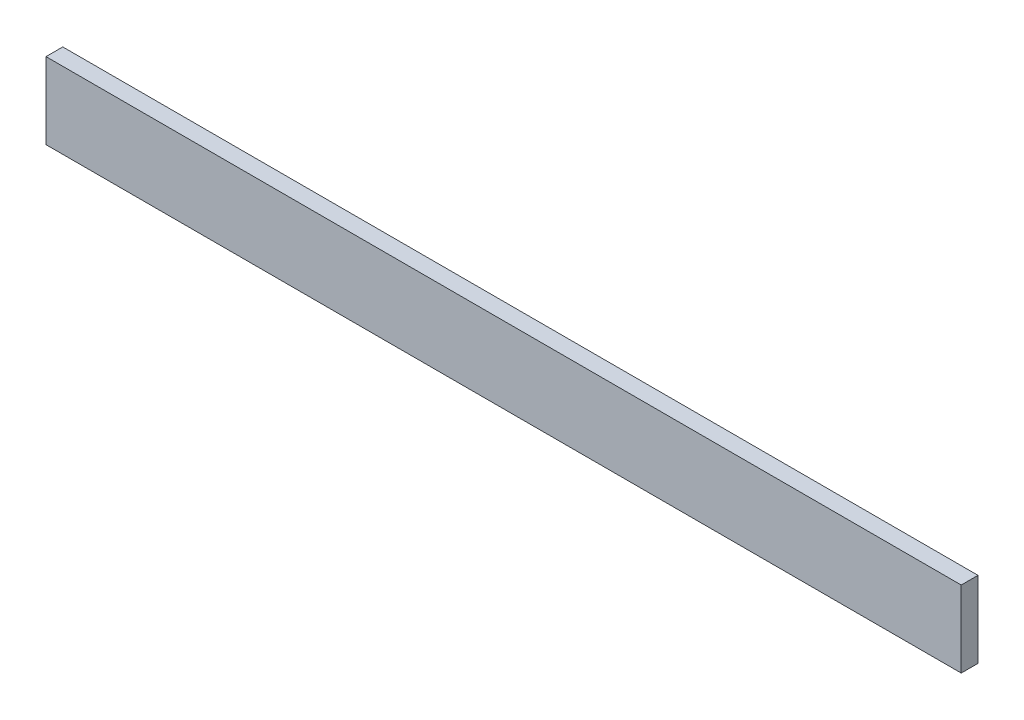
ISO-10303-21;
HEADER;
FILE_DESCRIPTION(('STEP AP214'),'2;1');
FILE_NAME('part.step','',(''),(''),'','','');
FILE_SCHEMA(('AUTOMOTIVE_DESIGN { 1 0 10303 214 1 1 1 1 }'));
ENDSEC;
DATA;
#1=APPLICATION_CONTEXT('core data for automotive mechanical design processes');
#2=APPLICATION_PROTOCOL_DEFINITION('international standard','automotive_design',2000,#1);
#3=PRODUCT_CONTEXT('',#1,'mechanical');
#4=PRODUCT('Part','Part','',(#3));
#5=PRODUCT_RELATED_PRODUCT_CATEGORY('part','',(#4));
#6=PRODUCT_DEFINITION_FORMATION('','',#4);
#7=PRODUCT_DEFINITION_CONTEXT('part definition',#1,'design');
#8=PRODUCT_DEFINITION('design','',#6,#7);
#9=PRODUCT_DEFINITION_SHAPE('','',#8);
#10=(LENGTH_UNIT() NAMED_UNIT(*) SI_UNIT(.MILLI.,.METRE.));
#11=(NAMED_UNIT(*) PLANE_ANGLE_UNIT() SI_UNIT($,.RADIAN.));
#12=(NAMED_UNIT(*) SI_UNIT($,.STERADIAN.) SOLID_ANGLE_UNIT());
#13=UNCERTAINTY_MEASURE_WITH_UNIT(LENGTH_MEASURE(1.E-05),#10,'distance_accuracy_value','');
#14=(GEOMETRIC_REPRESENTATION_CONTEXT(3) GLOBAL_UNCERTAINTY_ASSIGNED_CONTEXT((#13)) GLOBAL_UNIT_ASSIGNED_CONTEXT((#10,
#11,#12)) REPRESENTATION_CONTEXT('',''));
#15=CARTESIAN_POINT('',(0.,0.,0.));
#16=DIRECTION('',(0.,0.,1.));
#17=DIRECTION('',(1.,0.,0.));
#18=AXIS2_PLACEMENT_3D('',#15,#16,#17);
#19=CARTESIAN_POINT('',(600.000000000001,50.,22.));
#20=DIRECTION('',(-1.,0.,0.));
#21=DIRECTION('',(0.,0.,1.));
#22=AXIS2_PLACEMENT_3D('',#19,#20,#21);
#23=PLANE('',#22);
#24=DIRECTION('',(0.,1.,0.));
#25=VECTOR('',#24,1.);
#26=CARTESIAN_POINT('',(600.000000000001,50.,0.));
#27=LINE('',#26,#25);
#28=CARTESIAN_POINT('',(600.000000000001,-50.,0.));
#29=VERTEX_POINT('',#28);
#30=CARTESIAN_POINT('',(600.000000000001,50.,0.));
#31=VERTEX_POINT('',#30);
#32=EDGE_CURVE('E95',#29,#31,#27,.T.);
#33=ORIENTED_EDGE('',*,*,#32,.T.);
#34=DIRECTION('',(0.,0.,-1.));
#35=VECTOR('',#34,1.);
#36=CARTESIAN_POINT('',(600.000000000001,50.,22.));
#37=LINE('',#36,#35);
#38=CARTESIAN_POINT('',(600.000000000001,50.,22.));
#39=VERTEX_POINT('',#38);
#40=EDGE_CURVE('E11',#39,#31,#37,.T.);
#41=ORIENTED_EDGE('',*,*,#40,.F.);
#42=DIRECTION('',(0.,1.,0.));
#43=VECTOR('',#42,1.);
#44=CARTESIAN_POINT('',(600.000000000001,50.,22.));
#45=LINE('',#44,#43);
#46=CARTESIAN_POINT('',(600.000000000001,-50.,22.));
#47=VERTEX_POINT('',#46);
#48=EDGE_CURVE('E83',#47,#39,#45,.T.);
#49=ORIENTED_EDGE('',*,*,#48,.F.);
#50=DIRECTION('',(0.,0.,-1.));
#51=VECTOR('',#50,1.);
#52=CARTESIAN_POINT('',(600.000000000001,-50.,22.));
#53=LINE('',#52,#51);
#54=EDGE_CURVE('E91',#47,#29,#53,.T.);
#55=ORIENTED_EDGE('',*,*,#54,.T.);
#56=EDGE_LOOP('',(#33,#41,#49,#55));
#57=FACE_BOUND('',#56,.T.);
#58=ADVANCED_FACE('F32',(#57),#23,.F.);
#59=CARTESIAN_POINT('',(600.000000000001,50.,22.));
#60=DIRECTION('',(0.,-1.,0.));
#61=DIRECTION('',(0.,0.,-1.));
#62=AXIS2_PLACEMENT_3D('',#59,#60,#61);
#63=PLANE('',#62);
#64=DIRECTION('',(-1.,0.,0.));
#65=VECTOR('',#64,1.);
#66=CARTESIAN_POINT('',(600.000000000001,50.,0.));
#67=LINE('',#66,#65);
#68=CARTESIAN_POINT('',(-600.000000000001,50.,0.));
#69=VERTEX_POINT('',#68);
#70=EDGE_CURVE('E87',#31,#69,#67,.T.);
#71=ORIENTED_EDGE('',*,*,#70,.T.);
#72=DIRECTION('',(0.,0.,-1.));
#73=VECTOR('',#72,1.);
#74=CARTESIAN_POINT('',(-600.000000000001,50.,22.));
#75=LINE('',#74,#73);
#76=CARTESIAN_POINT('',(-600.000000000001,50.,22.));
#77=VERTEX_POINT('',#76);
#78=EDGE_CURVE('E40',#77,#69,#75,.T.);
#79=ORIENTED_EDGE('',*,*,#78,.F.);
#80=DIRECTION('',(-1.,0.,0.));
#81=VECTOR('',#80,1.);
#82=CARTESIAN_POINT('',(600.000000000001,50.,22.));
#83=LINE('',#82,#81);
#84=EDGE_CURVE('E78',#39,#77,#83,.T.);
#85=ORIENTED_EDGE('',*,*,#84,.F.);
#86=ORIENTED_EDGE('',*,*,#40,.T.);
#87=EDGE_LOOP('',(#71,#79,#85,#86));
#88=FACE_BOUND('',#87,.T.);
#89=ADVANCED_FACE('F86',(#88),#63,.F.);
#90=CARTESIAN_POINT('',(-600.000000000001,50.,22.));
#91=DIRECTION('',(1.,0.,0.));
#92=DIRECTION('',(0.,0.,-1.));
#93=AXIS2_PLACEMENT_3D('',#90,#91,#92);
#94=PLANE('',#93);
#95=DIRECTION('',(0.,-1.,0.));
#96=VECTOR('',#95,1.);
#97=CARTESIAN_POINT('',(-600.000000000001,50.,0.));
#98=LINE('',#97,#96);
#99=CARTESIAN_POINT('',(-600.000000000001,-50.,0.));
#100=VERTEX_POINT('',#99);
#101=EDGE_CURVE('E65',#69,#100,#98,.T.);
#102=ORIENTED_EDGE('',*,*,#101,.T.);
#103=DIRECTION('',(0.,0.,-1.));
#104=VECTOR('',#103,1.);
#105=CARTESIAN_POINT('',(-600.000000000001,-50.,22.));
#106=LINE('',#105,#104);
#107=CARTESIAN_POINT('',(-600.000000000001,-50.,22.));
#108=VERTEX_POINT('',#107);
#109=EDGE_CURVE('E88',#108,#100,#106,.T.);
#110=ORIENTED_EDGE('',*,*,#109,.F.);
#111=DIRECTION('',(0.,-1.,0.));
#112=VECTOR('',#111,1.);
#113=CARTESIAN_POINT('',(-600.000000000001,50.,22.));
#114=LINE('',#113,#112);
#115=EDGE_CURVE('E81',#77,#108,#114,.T.);
#116=ORIENTED_EDGE('',*,*,#115,.F.);
#117=ORIENTED_EDGE('',*,*,#78,.T.);
#118=EDGE_LOOP('',(#102,#110,#116,#117));
#119=FACE_BOUND('',#118,.T.);
#120=ADVANCED_FACE('F89',(#119),#94,.F.);
#121=CARTESIAN_POINT('',(600.000000000001,-50.,22.));
#122=DIRECTION('',(0.,1.,0.));
#123=DIRECTION('',(0.,0.,1.));
#124=AXIS2_PLACEMENT_3D('',#121,#122,#123);
#125=PLANE('',#124);
#126=DIRECTION('',(1.,0.,0.));
#127=VECTOR('',#126,1.);
#128=CARTESIAN_POINT('',(600.000000000001,-50.,0.));
#129=LINE('',#128,#127);
#130=EDGE_CURVE('E71',#100,#29,#129,.T.);
#131=ORIENTED_EDGE('',*,*,#130,.T.);
#132=ORIENTED_EDGE('',*,*,#54,.F.);
#133=DIRECTION('',(1.,0.,0.));
#134=VECTOR('',#133,1.);
#135=CARTESIAN_POINT('',(600.000000000001,-50.,22.));
#136=LINE('',#135,#134);
#137=EDGE_CURVE('E48',#108,#47,#136,.T.);
#138=ORIENTED_EDGE('',*,*,#137,.F.);
#139=ORIENTED_EDGE('',*,*,#109,.T.);
#140=EDGE_LOOP('',(#131,#132,#138,#139));
#141=FACE_BOUND('',#140,.T.);
#142=ADVANCED_FACE('F102',(#141),#125,.F.);
#143=CARTESIAN_POINT('',(600.000000000001,-50.,22.));
#144=DIRECTION('',(0.,0.,-1.));
#145=DIRECTION('',(-1.,0.,0.));
#146=AXIS2_PLACEMENT_3D('',#143,#144,#145);
#147=PLANE('',#146);
#148=ORIENTED_EDGE('',*,*,#48,.T.);
#149=ORIENTED_EDGE('',*,*,#84,.T.);
#150=ORIENTED_EDGE('',*,*,#115,.T.);
#151=ORIENTED_EDGE('',*,*,#137,.T.);
#152=EDGE_LOOP('',(#148,#149,#150,#151));
#153=FACE_BOUND('',#152,.T.);
#154=ADVANCED_FACE('F79',(#153),#147,.F.);
#155=CARTESIAN_POINT('',(600.000000000001,-50.,0.));
#156=DIRECTION('',(0.,0.,-1.));
#157=DIRECTION('',(-1.,0.,0.));
#158=AXIS2_PLACEMENT_3D('',#155,#156,#157);
#159=PLANE('',#158);
#160=ORIENTED_EDGE('',*,*,#32,.F.);
#161=ORIENTED_EDGE('',*,*,#130,.F.);
#162=ORIENTED_EDGE('',*,*,#101,.F.);
#163=ORIENTED_EDGE('',*,*,#70,.F.);
#164=EDGE_LOOP('',(#160,#161,#162,#163));
#165=FACE_BOUND('',#164,.T.);
#166=ADVANCED_FACE('F105',(#165),#159,.T.);
#167=CLOSED_SHELL('',(#58,#89,#120,#142,#154,#166));
#168=MANIFOLD_SOLID_BREP('B2',#167);
#169=ADVANCED_BREP_SHAPE_REPRESENTATION('',(#18,#168),#14);
#170=SHAPE_DEFINITION_REPRESENTATION(#9,#169);
ENDSEC;
END-ISO-10303-21;
